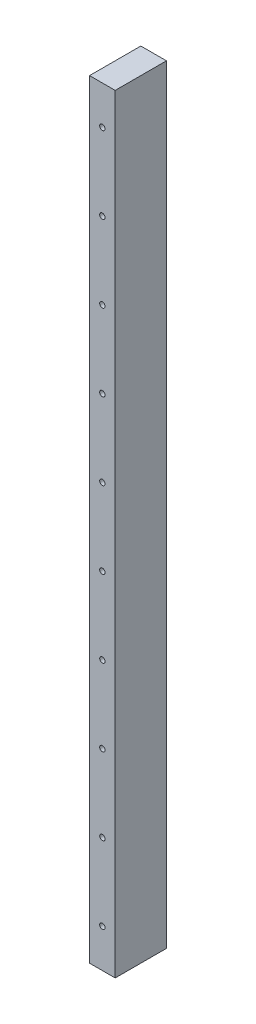
ISO-10303-21;
HEADER;
FILE_DESCRIPTION(('STEP AP214'),'2;1');
FILE_NAME('part.step','',(''),(''),'','','');
FILE_SCHEMA(('AUTOMOTIVE_DESIGN { 1 0 10303 214 1 1 1 1 }'));
ENDSEC;
DATA;
#1=APPLICATION_CONTEXT('core data for automotive mechanical design processes');
#2=APPLICATION_PROTOCOL_DEFINITION('international standard','automotive_design',2000,#1);
#3=PRODUCT_CONTEXT('',#1,'mechanical');
#4=PRODUCT('Part','Part','',(#3));
#5=PRODUCT_RELATED_PRODUCT_CATEGORY('part','',(#4));
#6=PRODUCT_DEFINITION_FORMATION('','',#4);
#7=PRODUCT_DEFINITION_CONTEXT('part definition',#1,'design');
#8=PRODUCT_DEFINITION('design','',#6,#7);
#9=PRODUCT_DEFINITION_SHAPE('','',#8);
#10=(LENGTH_UNIT() NAMED_UNIT(*) SI_UNIT(.MILLI.,.METRE.));
#11=(NAMED_UNIT(*) PLANE_ANGLE_UNIT() SI_UNIT($,.RADIAN.));
#12=(NAMED_UNIT(*) SI_UNIT($,.STERADIAN.) SOLID_ANGLE_UNIT());
#13=UNCERTAINTY_MEASURE_WITH_UNIT(LENGTH_MEASURE(1.E-05),#10,'distance_accuracy_value','');
#14=(GEOMETRIC_REPRESENTATION_CONTEXT(3) GLOBAL_UNCERTAINTY_ASSIGNED_CONTEXT((#13)) GLOBAL_UNIT_ASSIGNED_CONTEXT((#10,
#11,#12)) REPRESENTATION_CONTEXT('',''));
#15=CARTESIAN_POINT('',(0.,0.,0.));
#16=DIRECTION('',(0.,0.,1.));
#17=DIRECTION('',(1.,0.,0.));
#18=AXIS2_PLACEMENT_3D('',#15,#16,#17);
#19=CARTESIAN_POINT('',(-250.,1220.,-135.));
#20=DIRECTION('',(0.,-1.,0.));
#21=DIRECTION('',(0.,0.,-1.));
#22=AXIS2_PLACEMENT_3D('',#19,#20,#21);
#23=PLANE('',#22);
#24=DIRECTION('',(0.,0.,-1.));
#25=VECTOR('',#24,1.);
#26=CARTESIAN_POINT('',(-230.,1220.,-135.));
#27=LINE('',#26,#25);
#28=CARTESIAN_POINT('',(-230.,1220.,-135.));
#29=VERTEX_POINT('',#28);
#30=CARTESIAN_POINT('',(-230.,1220.,-175.));
#31=VERTEX_POINT('',#30);
#32=EDGE_CURVE('E249',#29,#31,#27,.T.);
#33=ORIENTED_EDGE('',*,*,#32,.F.);
#34=DIRECTION('',(1.,0.,0.));
#35=VECTOR('',#34,1.);
#36=CARTESIAN_POINT('',(-250.,1220.,-135.));
#37=LINE('',#36,#35);
#38=CARTESIAN_POINT('',(-250.,1220.,-135.));
#39=VERTEX_POINT('',#38);
#40=EDGE_CURVE('E11',#39,#29,#37,.T.);
#41=ORIENTED_EDGE('',*,*,#40,.F.);
#42=DIRECTION('',(0.,0.,-1.));
#43=VECTOR('',#42,1.);
#44=CARTESIAN_POINT('',(-250.,1220.,-135.));
#45=LINE('',#44,#43);
#46=CARTESIAN_POINT('',(-250.,1220.,-175.));
#47=VERTEX_POINT('',#46);
#48=EDGE_CURVE('E250',#39,#47,#45,.T.);
#49=ORIENTED_EDGE('',*,*,#48,.T.);
#50=DIRECTION('',(1.,0.,0.));
#51=VECTOR('',#50,1.);
#52=CARTESIAN_POINT('',(-250.,1220.,-175.));
#53=LINE('',#52,#51);
#54=EDGE_CURVE('E42',#47,#31,#53,.T.);
#55=ORIENTED_EDGE('',*,*,#54,.T.);
#56=EDGE_LOOP('',(#33,#41,#49,#55));
#57=FACE_BOUND('',#56,.T.);
#58=ADVANCED_FACE('F39',(#57),#23,.T.);
#59=CARTESIAN_POINT('',(-250.,1820.,-135.));
#60=DIRECTION('',(0.,0.,1.));
#61=DIRECTION('',(1.,0.,0.));
#62=AXIS2_PLACEMENT_3D('',#59,#60,#61);
#63=PLANE('',#62);
#64=CARTESIAN_POINT('',(-240.,1610.,-135.));
#65=DIRECTION('',(0.,0.,1.));
#66=DIRECTION('',(1.,0.,0.));
#67=AXIS2_PLACEMENT_3D('',#64,#65,#66);
#68=CIRCLE('',#67,2.09999999999999);
#69=CARTESIAN_POINT('',(-237.9,1610.,-135.));
#70=VERTEX_POINT('',#69);
#71=EDGE_CURVE('E140',#70,#70,#68,.T.);
#72=ORIENTED_EDGE('',*,*,#71,.F.);
#73=EDGE_LOOP('',(#72));
#74=FACE_BOUND('',#73,.T.);
#75=CARTESIAN_POINT('',(-240.,1250.,-135.));
#76=DIRECTION('',(0.,0.,1.));
#77=DIRECTION('',(1.,0.,0.));
#78=AXIS2_PLACEMENT_3D('',#75,#76,#77);
#79=CIRCLE('',#78,2.09999999999999);
#80=CARTESIAN_POINT('',(-237.9,1250.,-135.));
#81=VERTEX_POINT('',#80);
#82=EDGE_CURVE('E139',#81,#81,#79,.T.);
#83=ORIENTED_EDGE('',*,*,#82,.F.);
#84=EDGE_LOOP('',(#83));
#85=FACE_BOUND('',#84,.T.);
#86=CARTESIAN_POINT('',(-240.,1310.,-135.));
#87=DIRECTION('',(0.,0.,1.));
#88=DIRECTION('',(1.,0.,0.));
#89=AXIS2_PLACEMENT_3D('',#86,#87,#88);
#90=CIRCLE('',#89,2.09999999999999);
#91=CARTESIAN_POINT('',(-237.9,1310.,-135.));
#92=VERTEX_POINT('',#91);
#93=EDGE_CURVE('E153',#92,#92,#90,.T.);
#94=ORIENTED_EDGE('',*,*,#93,.F.);
#95=EDGE_LOOP('',(#94));
#96=FACE_BOUND('',#95,.T.);
#97=CARTESIAN_POINT('',(-240.,1370.,-135.));
#98=DIRECTION('',(0.,0.,1.));
#99=DIRECTION('',(1.,0.,0.));
#100=AXIS2_PLACEMENT_3D('',#97,#98,#99);
#101=CIRCLE('',#100,2.09999999999999);
#102=CARTESIAN_POINT('',(-237.9,1370.,-135.));
#103=VERTEX_POINT('',#102);
#104=EDGE_CURVE('E161',#103,#103,#101,.T.);
#105=ORIENTED_EDGE('',*,*,#104,.F.);
#106=EDGE_LOOP('',(#105));
#107=FACE_BOUND('',#106,.T.);
#108=CARTESIAN_POINT('',(-240.,1430.,-135.));
#109=DIRECTION('',(0.,0.,1.));
#110=DIRECTION('',(1.,0.,0.));
#111=AXIS2_PLACEMENT_3D('',#108,#109,#110);
#112=CIRCLE('',#111,2.09999999999999);
#113=CARTESIAN_POINT('',(-237.9,1430.,-135.));
#114=VERTEX_POINT('',#113);
#115=EDGE_CURVE('E169',#114,#114,#112,.T.);
#116=ORIENTED_EDGE('',*,*,#115,.F.);
#117=EDGE_LOOP('',(#116));
#118=FACE_BOUND('',#117,.T.);
#119=CARTESIAN_POINT('',(-240.,1490.,-135.));
#120=DIRECTION('',(0.,0.,1.));
#121=DIRECTION('',(1.,0.,0.));
#122=AXIS2_PLACEMENT_3D('',#119,#120,#121);
#123=CIRCLE('',#122,2.09999999999999);
#124=CARTESIAN_POINT('',(-237.9,1490.,-135.));
#125=VERTEX_POINT('',#124);
#126=EDGE_CURVE('E177',#125,#125,#123,.T.);
#127=ORIENTED_EDGE('',*,*,#126,.F.);
#128=EDGE_LOOP('',(#127));
#129=FACE_BOUND('',#128,.T.);
#130=CARTESIAN_POINT('',(-240.,1550.,-135.));
#131=DIRECTION('',(0.,0.,1.));
#132=DIRECTION('',(1.,0.,0.));
#133=AXIS2_PLACEMENT_3D('',#130,#131,#132);
#134=CIRCLE('',#133,2.09999999999999);
#135=CARTESIAN_POINT('',(-237.9,1550.,-135.));
#136=VERTEX_POINT('',#135);
#137=EDGE_CURVE('E185',#136,#136,#134,.T.);
#138=ORIENTED_EDGE('',*,*,#137,.F.);
#139=EDGE_LOOP('',(#138));
#140=FACE_BOUND('',#139,.T.);
#141=CARTESIAN_POINT('',(-240.,1670.,-135.));
#142=DIRECTION('',(0.,0.,1.));
#143=DIRECTION('',(1.,0.,0.));
#144=AXIS2_PLACEMENT_3D('',#141,#142,#143);
#145=CIRCLE('',#144,2.09999999999999);
#146=CARTESIAN_POINT('',(-237.9,1670.,-135.));
#147=VERTEX_POINT('',#146);
#148=EDGE_CURVE('E193',#147,#147,#145,.T.);
#149=ORIENTED_EDGE('',*,*,#148,.F.);
#150=EDGE_LOOP('',(#149));
#151=FACE_BOUND('',#150,.T.);
#152=CARTESIAN_POINT('',(-240.,1730.,-135.));
#153=DIRECTION('',(0.,0.,1.));
#154=DIRECTION('',(1.,0.,0.));
#155=AXIS2_PLACEMENT_3D('',#152,#153,#154);
#156=CIRCLE('',#155,2.09999999999999);
#157=CARTESIAN_POINT('',(-237.9,1730.,-135.));
#158=VERTEX_POINT('',#157);
#159=EDGE_CURVE('E201',#158,#158,#156,.T.);
#160=ORIENTED_EDGE('',*,*,#159,.F.);
#161=EDGE_LOOP('',(#160));
#162=FACE_BOUND('',#161,.T.);
#163=CARTESIAN_POINT('',(-240.,1790.,-135.));
#164=DIRECTION('',(0.,0.,1.));
#165=DIRECTION('',(1.,0.,0.));
#166=AXIS2_PLACEMENT_3D('',#163,#164,#165);
#167=CIRCLE('',#166,2.09999999999999);
#168=CARTESIAN_POINT('',(-237.9,1790.,-135.));
#169=VERTEX_POINT('',#168);
#170=EDGE_CURVE('E209',#169,#169,#167,.T.);
#171=ORIENTED_EDGE('',*,*,#170,.F.);
#172=EDGE_LOOP('',(#171));
#173=FACE_BOUND('',#172,.T.);
#174=DIRECTION('',(0.,-1.,0.));
#175=VECTOR('',#174,1.);
#176=CARTESIAN_POINT('',(-230.,1820.,-135.));
#177=LINE('',#176,#175);
#178=CARTESIAN_POINT('',(-230.,1820.,-135.));
#179=VERTEX_POINT('',#178);
#180=EDGE_CURVE('E254',#179,#29,#177,.T.);
#181=ORIENTED_EDGE('',*,*,#180,.F.);
#182=DIRECTION('',(1.,0.,0.));
#183=VECTOR('',#182,1.);
#184=CARTESIAN_POINT('',(-250.,1820.,-135.));
#185=LINE('',#184,#183);
#186=CARTESIAN_POINT('',(-250.,1820.,-135.));
#187=VERTEX_POINT('',#186);
#188=EDGE_CURVE('E49',#187,#179,#185,.T.);
#189=ORIENTED_EDGE('',*,*,#188,.F.);
#190=DIRECTION('',(0.,-1.,0.));
#191=VECTOR('',#190,1.);
#192=CARTESIAN_POINT('',(-250.,1820.,-135.));
#193=LINE('',#192,#191);
#194=EDGE_CURVE('E260',#187,#39,#193,.T.);
#195=ORIENTED_EDGE('',*,*,#194,.T.);
#196=ORIENTED_EDGE('',*,*,#40,.T.);
#197=EDGE_LOOP('',(#181,#189,#195,#196));
#198=FACE_BOUND('',#197,.T.);
#199=ADVANCED_FACE('F283',(#74,#85,#96,#107,#118,#129,#140,#151,#162,#173,#198),#63,.T.);
#200=CARTESIAN_POINT('',(-250.,1820.,-175.));
#201=DIRECTION('',(0.,1.,0.));
#202=DIRECTION('',(0.,0.,1.));
#203=AXIS2_PLACEMENT_3D('',#200,#201,#202);
#204=PLANE('',#203);
#205=DIRECTION('',(0.,0.,1.));
#206=VECTOR('',#205,1.);
#207=CARTESIAN_POINT('',(-230.,1820.,-175.));
#208=LINE('',#207,#206);
#209=CARTESIAN_POINT('',(-230.,1820.,-175.));
#210=VERTEX_POINT('',#209);
#211=EDGE_CURVE('E270',#210,#179,#208,.T.);
#212=ORIENTED_EDGE('',*,*,#211,.F.);
#213=DIRECTION('',(1.,0.,0.));
#214=VECTOR('',#213,1.);
#215=CARTESIAN_POINT('',(-250.,1820.,-175.));
#216=LINE('',#215,#214);
#217=CARTESIAN_POINT('',(-250.,1820.,-175.));
#218=VERTEX_POINT('',#217);
#219=EDGE_CURVE('E277',#218,#210,#216,.T.);
#220=ORIENTED_EDGE('',*,*,#219,.F.);
#221=DIRECTION('',(0.,0.,1.));
#222=VECTOR('',#221,1.);
#223=CARTESIAN_POINT('',(-250.,1820.,-175.));
#224=LINE('',#223,#222);
#225=EDGE_CURVE('E257',#218,#187,#224,.T.);
#226=ORIENTED_EDGE('',*,*,#225,.T.);
#227=ORIENTED_EDGE('',*,*,#188,.T.);
#228=EDGE_LOOP('',(#212,#220,#226,#227));
#229=FACE_BOUND('',#228,.T.);
#230=ADVANCED_FACE('F286',(#229),#204,.T.);
#231=CARTESIAN_POINT('',(-250.,1220.,-175.));
#232=DIRECTION('',(0.,0.,-1.));
#233=DIRECTION('',(-1.,0.,0.));
#234=AXIS2_PLACEMENT_3D('',#231,#232,#233);
#235=PLANE('',#234);
#236=CARTESIAN_POINT('',(-240.,1250.,-175.));
#237=DIRECTION('',(0.,0.,-1.));
#238=DIRECTION('',(-1.,0.,0.));
#239=AXIS2_PLACEMENT_3D('',#236,#237,#238);
#240=CIRCLE('',#239,4.5);
#241=CARTESIAN_POINT('',(-244.5,1250.,-175.));
#242=VERTEX_POINT('',#241);
#243=EDGE_CURVE('E217',#242,#242,#240,.T.);
#244=ORIENTED_EDGE('',*,*,#243,.F.);
#245=EDGE_LOOP('',(#244));
#246=FACE_BOUND('',#245,.T.);
#247=CARTESIAN_POINT('',(-240.,1430.,-175.));
#248=DIRECTION('',(0.,0.,-1.));
#249=DIRECTION('',(-1.,0.,0.));
#250=AXIS2_PLACEMENT_3D('',#247,#248,#249);
#251=CIRCLE('',#250,4.5);
#252=CARTESIAN_POINT('',(-244.5,1430.,-175.));
#253=VERTEX_POINT('',#252);
#254=EDGE_CURVE('E225',#253,#253,#251,.T.);
#255=ORIENTED_EDGE('',*,*,#254,.F.);
#256=EDGE_LOOP('',(#255));
#257=FACE_BOUND('',#256,.T.);
#258=CARTESIAN_POINT('',(-240.,1610.,-175.));
#259=DIRECTION('',(0.,0.,-1.));
#260=DIRECTION('',(-1.,0.,0.));
#261=AXIS2_PLACEMENT_3D('',#258,#259,#260);
#262=CIRCLE('',#261,4.5);
#263=CARTESIAN_POINT('',(-244.5,1610.,-175.));
#264=VERTEX_POINT('',#263);
#265=EDGE_CURVE('E233',#264,#264,#262,.T.);
#266=ORIENTED_EDGE('',*,*,#265,.F.);
#267=EDGE_LOOP('',(#266));
#268=FACE_BOUND('',#267,.T.);
#269=CARTESIAN_POINT('',(-240.,1790.,-175.));
#270=DIRECTION('',(0.,0.,-1.));
#271=DIRECTION('',(-1.,0.,0.));
#272=AXIS2_PLACEMENT_3D('',#269,#270,#271);
#273=CIRCLE('',#272,4.5);
#274=CARTESIAN_POINT('',(-244.5,1790.,-175.));
#275=VERTEX_POINT('',#274);
#276=EDGE_CURVE('E241',#275,#275,#273,.T.);
#277=ORIENTED_EDGE('',*,*,#276,.F.);
#278=EDGE_LOOP('',(#277));
#279=FACE_BOUND('',#278,.T.);
#280=DIRECTION('',(0.,1.,0.));
#281=VECTOR('',#280,1.);
#282=CARTESIAN_POINT('',(-230.,1220.,-175.));
#283=LINE('',#282,#281);
#284=EDGE_CURVE('E266',#31,#210,#283,.T.);
#285=ORIENTED_EDGE('',*,*,#284,.F.);
#286=ORIENTED_EDGE('',*,*,#54,.F.);
#287=DIRECTION('',(0.,1.,0.));
#288=VECTOR('',#287,1.);
#289=CARTESIAN_POINT('',(-250.,1220.,-175.));
#290=LINE('',#289,#288);
#291=EDGE_CURVE('E253',#47,#218,#290,.T.);
#292=ORIENTED_EDGE('',*,*,#291,.T.);
#293=ORIENTED_EDGE('',*,*,#219,.T.);
#294=EDGE_LOOP('',(#285,#286,#292,#293));
#295=FACE_BOUND('',#294,.T.);
#296=ADVANCED_FACE('F280',(#246,#257,#268,#279,#295),#235,.T.);
#297=CARTESIAN_POINT('',(-250.,0.,0.));
#298=DIRECTION('',(1.,0.,0.));
#299=DIRECTION('',(0.,0.,-1.));
#300=AXIS2_PLACEMENT_3D('',#297,#298,#299);
#301=PLANE('',#300);
#302=ORIENTED_EDGE('',*,*,#48,.F.);
#303=ORIENTED_EDGE('',*,*,#194,.F.);
#304=ORIENTED_EDGE('',*,*,#225,.F.);
#305=ORIENTED_EDGE('',*,*,#291,.F.);
#306=EDGE_LOOP('',(#302,#303,#304,#305));
#307=FACE_BOUND('',#306,.T.);
#308=ADVANCED_FACE('F288',(#307),#301,.F.);
#309=CARTESIAN_POINT('',(-230.,0.,0.));
#310=DIRECTION('',(1.,0.,0.));
#311=DIRECTION('',(0.,0.,-1.));
#312=AXIS2_PLACEMENT_3D('',#309,#310,#311);
#313=PLANE('',#312);
#314=ORIENTED_EDGE('',*,*,#32,.T.);
#315=ORIENTED_EDGE('',*,*,#284,.T.);
#316=ORIENTED_EDGE('',*,*,#211,.T.);
#317=ORIENTED_EDGE('',*,*,#180,.T.);
#318=EDGE_LOOP('',(#314,#315,#316,#317));
#319=FACE_BOUND('',#318,.T.);
#320=ADVANCED_FACE('F282',(#319),#313,.T.);
#321=CARTESIAN_POINT('',(-240.,1790.,-160.));
#322=DIRECTION('',(0.,0.,-1.));
#323=DIRECTION('',(-1.,0.,0.));
#324=AXIS2_PLACEMENT_3D('',#321,#322,#323);
#325=CONICAL_SURFACE('',#324,4.5,1.02974425867665);
#326=CARTESIAN_POINT('',(-240.,1790.,-157.296127214376));
#327=VERTEX_POINT('',#326);
#328=VERTEX_LOOP('',#327);
#329=FACE_BOUND('',#328,.T.);
#330=CARTESIAN_POINT('',(-240.,1790.,-160.));
#331=DIRECTION('',(0.,0.,-1.));
#332=DIRECTION('',(-1.,0.,0.));
#333=AXIS2_PLACEMENT_3D('',#330,#331,#332);
#334=CIRCLE('',#333,4.5);
#335=CARTESIAN_POINT('',(-244.5,1790.,-160.));
#336=VERTEX_POINT('',#335);
#337=EDGE_CURVE('E245',#336,#336,#334,.T.);
#338=ORIENTED_EDGE('',*,*,#337,.T.);
#339=EDGE_LOOP('',(#338));
#340=FACE_BOUND('',#339,.T.);
#341=ADVANCED_FACE('F295',(#329,#340),#325,.F.);
#342=CARTESIAN_POINT('',(-240.,1790.,-175.));
#343=DIRECTION('',(0.,0.,-1.));
#344=DIRECTION('',(-1.,0.,0.));
#345=AXIS2_PLACEMENT_3D('',#342,#343,#344);
#346=CYLINDRICAL_SURFACE('',#345,4.5);
#347=ORIENTED_EDGE('',*,*,#337,.F.);
#348=EDGE_LOOP('',(#347));
#349=FACE_BOUND('',#348,.T.);
#350=ORIENTED_EDGE('',*,*,#276,.T.);
#351=EDGE_LOOP('',(#350));
#352=FACE_BOUND('',#351,.T.);
#353=ADVANCED_FACE('F370',(#349,#352),#346,.F.);
#354=CARTESIAN_POINT('',(-240.,1610.,-160.));
#355=DIRECTION('',(0.,0.,-1.));
#356=DIRECTION('',(-1.,0.,0.));
#357=AXIS2_PLACEMENT_3D('',#354,#355,#356);
#358=CONICAL_SURFACE('',#357,4.5,1.02974425867665);
#359=CARTESIAN_POINT('',(-240.,1610.,-157.296127214376));
#360=VERTEX_POINT('',#359);
#361=VERTEX_LOOP('',#360);
#362=FACE_BOUND('',#361,.T.);
#363=CARTESIAN_POINT('',(-240.,1610.,-160.));
#364=DIRECTION('',(0.,0.,-1.));
#365=DIRECTION('',(-1.,0.,0.));
#366=AXIS2_PLACEMENT_3D('',#363,#364,#365);
#367=CIRCLE('',#366,4.5);
#368=CARTESIAN_POINT('',(-244.5,1610.,-160.));
#369=VERTEX_POINT('',#368);
#370=EDGE_CURVE('E237',#369,#369,#367,.T.);
#371=ORIENTED_EDGE('',*,*,#370,.T.);
#372=EDGE_LOOP('',(#371));
#373=FACE_BOUND('',#372,.T.);
#374=ADVANCED_FACE('F366',(#362,#373),#358,.F.);
#375=CARTESIAN_POINT('',(-240.,1610.,-175.));
#376=DIRECTION('',(0.,0.,-1.));
#377=DIRECTION('',(-1.,0.,0.));
#378=AXIS2_PLACEMENT_3D('',#375,#376,#377);
#379=CYLINDRICAL_SURFACE('',#378,4.5);
#380=ORIENTED_EDGE('',*,*,#370,.F.);
#381=EDGE_LOOP('',(#380));
#382=FACE_BOUND('',#381,.T.);
#383=ORIENTED_EDGE('',*,*,#265,.T.);
#384=EDGE_LOOP('',(#383));
#385=FACE_BOUND('',#384,.T.);
#386=ADVANCED_FACE('F362',(#382,#385),#379,.F.);
#387=CARTESIAN_POINT('',(-240.,1430.,-160.));
#388=DIRECTION('',(0.,0.,-1.));
#389=DIRECTION('',(-1.,0.,0.));
#390=AXIS2_PLACEMENT_3D('',#387,#388,#389);
#391=CONICAL_SURFACE('',#390,4.5,1.02974425867665);
#392=CARTESIAN_POINT('',(-240.,1430.,-157.296127214376));
#393=VERTEX_POINT('',#392);
#394=VERTEX_LOOP('',#393);
#395=FACE_BOUND('',#394,.T.);
#396=CARTESIAN_POINT('',(-240.,1430.,-160.));
#397=DIRECTION('',(0.,0.,-1.));
#398=DIRECTION('',(-1.,0.,0.));
#399=AXIS2_PLACEMENT_3D('',#396,#397,#398);
#400=CIRCLE('',#399,4.5);
#401=CARTESIAN_POINT('',(-244.5,1430.,-160.));
#402=VERTEX_POINT('',#401);
#403=EDGE_CURVE('E229',#402,#402,#400,.T.);
#404=ORIENTED_EDGE('',*,*,#403,.T.);
#405=EDGE_LOOP('',(#404));
#406=FACE_BOUND('',#405,.T.);
#407=ADVANCED_FACE('F358',(#395,#406),#391,.F.);
#408=CARTESIAN_POINT('',(-240.,1430.,-175.));
#409=DIRECTION('',(0.,0.,-1.));
#410=DIRECTION('',(-1.,0.,0.));
#411=AXIS2_PLACEMENT_3D('',#408,#409,#410);
#412=CYLINDRICAL_SURFACE('',#411,4.5);
#413=ORIENTED_EDGE('',*,*,#403,.F.);
#414=EDGE_LOOP('',(#413));
#415=FACE_BOUND('',#414,.T.);
#416=ORIENTED_EDGE('',*,*,#254,.T.);
#417=EDGE_LOOP('',(#416));
#418=FACE_BOUND('',#417,.T.);
#419=ADVANCED_FACE('F354',(#415,#418),#412,.F.);
#420=CARTESIAN_POINT('',(-240.,1250.,-160.));
#421=DIRECTION('',(0.,0.,-1.));
#422=DIRECTION('',(-1.,0.,0.));
#423=AXIS2_PLACEMENT_3D('',#420,#421,#422);
#424=CONICAL_SURFACE('',#423,4.5,1.02974425867665);
#425=CARTESIAN_POINT('',(-240.,1250.,-157.296127214376));
#426=VERTEX_POINT('',#425);
#427=VERTEX_LOOP('',#426);
#428=FACE_BOUND('',#427,.T.);
#429=CARTESIAN_POINT('',(-240.,1250.,-160.));
#430=DIRECTION('',(0.,0.,-1.));
#431=DIRECTION('',(-1.,0.,0.));
#432=AXIS2_PLACEMENT_3D('',#429,#430,#431);
#433=CIRCLE('',#432,4.5);
#434=CARTESIAN_POINT('',(-244.5,1250.,-160.));
#435=VERTEX_POINT('',#434);
#436=EDGE_CURVE('E221',#435,#435,#433,.T.);
#437=ORIENTED_EDGE('',*,*,#436,.T.);
#438=EDGE_LOOP('',(#437));
#439=FACE_BOUND('',#438,.T.);
#440=ADVANCED_FACE('F350',(#428,#439),#424,.F.);
#441=CARTESIAN_POINT('',(-240.,1250.,-175.));
#442=DIRECTION('',(0.,0.,-1.));
#443=DIRECTION('',(-1.,0.,0.));
#444=AXIS2_PLACEMENT_3D('',#441,#442,#443);
#445=CYLINDRICAL_SURFACE('',#444,4.5);
#446=ORIENTED_EDGE('',*,*,#436,.F.);
#447=EDGE_LOOP('',(#446));
#448=FACE_BOUND('',#447,.T.);
#449=ORIENTED_EDGE('',*,*,#243,.T.);
#450=EDGE_LOOP('',(#449));
#451=FACE_BOUND('',#450,.T.);
#452=ADVANCED_FACE('F342',(#448,#451),#445,.F.);
#453=CARTESIAN_POINT('',(-240.,1790.,-147.4));
#454=DIRECTION('',(0.,0.,1.));
#455=DIRECTION('',(1.,0.,0.));
#456=AXIS2_PLACEMENT_3D('',#453,#454,#455);
#457=CONICAL_SURFACE('',#456,2.09999999999999,1.02974425867665);
#458=CARTESIAN_POINT('',(-240.,1790.,-148.661807299958));
#459=VERTEX_POINT('',#458);
#460=VERTEX_LOOP('',#459);
#461=FACE_BOUND('',#460,.T.);
#462=CARTESIAN_POINT('',(-240.,1790.,-147.4));
#463=DIRECTION('',(0.,0.,1.));
#464=DIRECTION('',(1.,0.,0.));
#465=AXIS2_PLACEMENT_3D('',#462,#463,#464);
#466=CIRCLE('',#465,2.09999999999999);
#467=CARTESIAN_POINT('',(-237.9,1790.,-147.4));
#468=VERTEX_POINT('',#467);
#469=EDGE_CURVE('E213',#468,#468,#466,.T.);
#470=ORIENTED_EDGE('',*,*,#469,.T.);
#471=EDGE_LOOP('',(#470));
#472=FACE_BOUND('',#471,.T.);
#473=ADVANCED_FACE('F332',(#461,#472),#457,.F.);
#474=CARTESIAN_POINT('',(-240.,1790.,-135.));
#475=DIRECTION('',(0.,0.,1.));
#476=DIRECTION('',(1.,0.,0.));
#477=AXIS2_PLACEMENT_3D('',#474,#475,#476);
#478=CYLINDRICAL_SURFACE('',#477,2.09999999999999);
#479=ORIENTED_EDGE('',*,*,#469,.F.);
#480=EDGE_LOOP('',(#479));
#481=FACE_BOUND('',#480,.T.);
#482=ORIENTED_EDGE('',*,*,#170,.T.);
#483=EDGE_LOOP('',(#482));
#484=FACE_BOUND('',#483,.T.);
#485=ADVANCED_FACE('F329',(#481,#484),#478,.F.);
#486=CARTESIAN_POINT('',(-240.,1730.,-147.4));
#487=DIRECTION('',(0.,0.,1.));
#488=DIRECTION('',(1.,0.,0.));
#489=AXIS2_PLACEMENT_3D('',#486,#487,#488);
#490=CONICAL_SURFACE('',#489,2.09999999999999,1.02974425867665);
#491=CARTESIAN_POINT('',(-240.,1730.,-148.661807299958));
#492=VERTEX_POINT('',#491);
#493=VERTEX_LOOP('',#492);
#494=FACE_BOUND('',#493,.T.);
#495=CARTESIAN_POINT('',(-240.,1730.,-147.4));
#496=DIRECTION('',(0.,0.,1.));
#497=DIRECTION('',(1.,0.,0.));
#498=AXIS2_PLACEMENT_3D('',#495,#496,#497);
#499=CIRCLE('',#498,2.09999999999999);
#500=CARTESIAN_POINT('',(-237.9,1730.,-147.4));
#501=VERTEX_POINT('',#500);
#502=EDGE_CURVE('E205',#501,#501,#499,.T.);
#503=ORIENTED_EDGE('',*,*,#502,.T.);
#504=EDGE_LOOP('',(#503));
#505=FACE_BOUND('',#504,.T.);
#506=ADVANCED_FACE('F331',(#494,#505),#490,.F.);
#507=CARTESIAN_POINT('',(-240.,1730.,-135.));
#508=DIRECTION('',(0.,0.,1.));
#509=DIRECTION('',(1.,0.,0.));
#510=AXIS2_PLACEMENT_3D('',#507,#508,#509);
#511=CYLINDRICAL_SURFACE('',#510,2.09999999999999);
#512=ORIENTED_EDGE('',*,*,#502,.F.);
#513=EDGE_LOOP('',(#512));
#514=FACE_BOUND('',#513,.T.);
#515=ORIENTED_EDGE('',*,*,#159,.T.);
#516=EDGE_LOOP('',(#515));
#517=FACE_BOUND('',#516,.T.);
#518=ADVANCED_FACE('F339',(#514,#517),#511,.F.);
#519=CARTESIAN_POINT('',(-240.,1670.,-147.4));
#520=DIRECTION('',(0.,0.,1.));
#521=DIRECTION('',(1.,0.,0.));
#522=AXIS2_PLACEMENT_3D('',#519,#520,#521);
#523=CONICAL_SURFACE('',#522,2.09999999999999,1.02974425867665);
#524=CARTESIAN_POINT('',(-240.,1670.,-148.661807299958));
#525=VERTEX_POINT('',#524);
#526=VERTEX_LOOP('',#525);
#527=FACE_BOUND('',#526,.T.);
#528=CARTESIAN_POINT('',(-240.,1670.,-147.4));
#529=DIRECTION('',(0.,0.,1.));
#530=DIRECTION('',(1.,0.,0.));
#531=AXIS2_PLACEMENT_3D('',#528,#529,#530);
#532=CIRCLE('',#531,2.09999999999999);
#533=CARTESIAN_POINT('',(-237.9,1670.,-147.4));
#534=VERTEX_POINT('',#533);
#535=EDGE_CURVE('E197',#534,#534,#532,.T.);
#536=ORIENTED_EDGE('',*,*,#535,.T.);
#537=EDGE_LOOP('',(#536));
#538=FACE_BOUND('',#537,.T.);
#539=ADVANCED_FACE('F439',(#527,#538),#523,.F.);
#540=CARTESIAN_POINT('',(-240.,1670.,-135.));
#541=DIRECTION('',(0.,0.,1.));
#542=DIRECTION('',(1.,0.,0.));
#543=AXIS2_PLACEMENT_3D('',#540,#541,#542);
#544=CYLINDRICAL_SURFACE('',#543,2.09999999999999);
#545=ORIENTED_EDGE('',*,*,#535,.F.);
#546=EDGE_LOOP('',(#545));
#547=FACE_BOUND('',#546,.T.);
#548=ORIENTED_EDGE('',*,*,#148,.T.);
#549=EDGE_LOOP('',(#548));
#550=FACE_BOUND('',#549,.T.);
#551=ADVANCED_FACE('F448',(#547,#550),#544,.F.);
#552=CARTESIAN_POINT('',(-240.,1550.,-147.4));
#553=DIRECTION('',(0.,0.,1.));
#554=DIRECTION('',(1.,0.,0.));
#555=AXIS2_PLACEMENT_3D('',#552,#553,#554);
#556=CONICAL_SURFACE('',#555,2.09999999999999,1.02974425867665);
#557=CARTESIAN_POINT('',(-240.,1550.,-148.661807299958));
#558=VERTEX_POINT('',#557);
#559=VERTEX_LOOP('',#558);
#560=FACE_BOUND('',#559,.T.);
#561=CARTESIAN_POINT('',(-240.,1550.,-147.4));
#562=DIRECTION('',(0.,0.,1.));
#563=DIRECTION('',(1.,0.,0.));
#564=AXIS2_PLACEMENT_3D('',#561,#562,#563);
#565=CIRCLE('',#564,2.09999999999999);
#566=CARTESIAN_POINT('',(-237.9,1550.,-147.4));
#567=VERTEX_POINT('',#566);
#568=EDGE_CURVE('E189',#567,#567,#565,.T.);
#569=ORIENTED_EDGE('',*,*,#568,.T.);
#570=EDGE_LOOP('',(#569));
#571=FACE_BOUND('',#570,.T.);
#572=ADVANCED_FACE('F458',(#560,#571),#556,.F.);
#573=CARTESIAN_POINT('',(-240.,1550.,-135.));
#574=DIRECTION('',(0.,0.,1.));
#575=DIRECTION('',(1.,0.,0.));
#576=AXIS2_PLACEMENT_3D('',#573,#574,#575);
#577=CYLINDRICAL_SURFACE('',#576,2.09999999999999);
#578=ORIENTED_EDGE('',*,*,#568,.F.);
#579=EDGE_LOOP('',(#578));
#580=FACE_BOUND('',#579,.T.);
#581=ORIENTED_EDGE('',*,*,#137,.T.);
#582=EDGE_LOOP('',(#581));
#583=FACE_BOUND('',#582,.T.);
#584=ADVANCED_FACE('F468',(#580,#583),#577,.F.);
#585=CARTESIAN_POINT('',(-240.,1490.,-147.4));
#586=DIRECTION('',(0.,0.,1.));
#587=DIRECTION('',(1.,0.,0.));
#588=AXIS2_PLACEMENT_3D('',#585,#586,#587);
#589=CONICAL_SURFACE('',#588,2.09999999999999,1.02974425867665);
#590=CARTESIAN_POINT('',(-240.,1490.,-148.661807299958));
#591=VERTEX_POINT('',#590);
#592=VERTEX_LOOP('',#591);
#593=FACE_BOUND('',#592,.T.);
#594=CARTESIAN_POINT('',(-240.,1490.,-147.4));
#595=DIRECTION('',(0.,0.,1.));
#596=DIRECTION('',(1.,0.,0.));
#597=AXIS2_PLACEMENT_3D('',#594,#595,#596);
#598=CIRCLE('',#597,2.09999999999999);
#599=CARTESIAN_POINT('',(-237.9,1490.,-147.4));
#600=VERTEX_POINT('',#599);
#601=EDGE_CURVE('E181',#600,#600,#598,.T.);
#602=ORIENTED_EDGE('',*,*,#601,.T.);
#603=EDGE_LOOP('',(#602));
#604=FACE_BOUND('',#603,.T.);
#605=ADVANCED_FACE('F478',(#593,#604),#589,.F.);
#606=CARTESIAN_POINT('',(-240.,1490.,-135.));
#607=DIRECTION('',(0.,0.,1.));
#608=DIRECTION('',(1.,0.,0.));
#609=AXIS2_PLACEMENT_3D('',#606,#607,#608);
#610=CYLINDRICAL_SURFACE('',#609,2.09999999999999);
#611=ORIENTED_EDGE('',*,*,#601,.F.);
#612=EDGE_LOOP('',(#611));
#613=FACE_BOUND('',#612,.T.);
#614=ORIENTED_EDGE('',*,*,#126,.T.);
#615=EDGE_LOOP('',(#614));
#616=FACE_BOUND('',#615,.T.);
#617=ADVANCED_FACE('F488',(#613,#616),#610,.F.);
#618=CARTESIAN_POINT('',(-240.,1430.,-147.4));
#619=DIRECTION('',(0.,0.,1.));
#620=DIRECTION('',(1.,0.,0.));
#621=AXIS2_PLACEMENT_3D('',#618,#619,#620);
#622=CONICAL_SURFACE('',#621,2.09999999999999,1.02974425867665);
#623=CARTESIAN_POINT('',(-240.,1430.,-148.661807299958));
#624=VERTEX_POINT('',#623);
#625=VERTEX_LOOP('',#624);
#626=FACE_BOUND('',#625,.T.);
#627=CARTESIAN_POINT('',(-240.,1430.,-147.4));
#628=DIRECTION('',(0.,0.,1.));
#629=DIRECTION('',(1.,0.,0.));
#630=AXIS2_PLACEMENT_3D('',#627,#628,#629);
#631=CIRCLE('',#630,2.09999999999999);
#632=CARTESIAN_POINT('',(-237.9,1430.,-147.4));
#633=VERTEX_POINT('',#632);
#634=EDGE_CURVE('E173',#633,#633,#631,.T.);
#635=ORIENTED_EDGE('',*,*,#634,.T.);
#636=EDGE_LOOP('',(#635));
#637=FACE_BOUND('',#636,.T.);
#638=ADVANCED_FACE('F498',(#626,#637),#622,.F.);
#639=CARTESIAN_POINT('',(-240.,1430.,-135.));
#640=DIRECTION('',(0.,0.,1.));
#641=DIRECTION('',(1.,0.,0.));
#642=AXIS2_PLACEMENT_3D('',#639,#640,#641);
#643=CYLINDRICAL_SURFACE('',#642,2.09999999999999);
#644=ORIENTED_EDGE('',*,*,#634,.F.);
#645=EDGE_LOOP('',(#644));
#646=FACE_BOUND('',#645,.T.);
#647=ORIENTED_EDGE('',*,*,#115,.T.);
#648=EDGE_LOOP('',(#647));
#649=FACE_BOUND('',#648,.T.);
#650=ADVANCED_FACE('F508',(#646,#649),#643,.F.);
#651=CARTESIAN_POINT('',(-240.,1370.,-147.4));
#652=DIRECTION('',(0.,0.,1.));
#653=DIRECTION('',(1.,0.,0.));
#654=AXIS2_PLACEMENT_3D('',#651,#652,#653);
#655=CONICAL_SURFACE('',#654,2.09999999999999,1.02974425867665);
#656=CARTESIAN_POINT('',(-240.,1370.,-148.661807299958));
#657=VERTEX_POINT('',#656);
#658=VERTEX_LOOP('',#657);
#659=FACE_BOUND('',#658,.T.);
#660=CARTESIAN_POINT('',(-240.,1370.,-147.4));
#661=DIRECTION('',(0.,0.,1.));
#662=DIRECTION('',(1.,0.,0.));
#663=AXIS2_PLACEMENT_3D('',#660,#661,#662);
#664=CIRCLE('',#663,2.09999999999999);
#665=CARTESIAN_POINT('',(-237.9,1370.,-147.4));
#666=VERTEX_POINT('',#665);
#667=EDGE_CURVE('E165',#666,#666,#664,.T.);
#668=ORIENTED_EDGE('',*,*,#667,.T.);
#669=EDGE_LOOP('',(#668));
#670=FACE_BOUND('',#669,.T.);
#671=ADVANCED_FACE('F518',(#659,#670),#655,.F.);
#672=CARTESIAN_POINT('',(-240.,1370.,-135.));
#673=DIRECTION('',(0.,0.,1.));
#674=DIRECTION('',(1.,0.,0.));
#675=AXIS2_PLACEMENT_3D('',#672,#673,#674);
#676=CYLINDRICAL_SURFACE('',#675,2.09999999999999);
#677=ORIENTED_EDGE('',*,*,#667,.F.);
#678=EDGE_LOOP('',(#677));
#679=FACE_BOUND('',#678,.T.);
#680=ORIENTED_EDGE('',*,*,#104,.T.);
#681=EDGE_LOOP('',(#680));
#682=FACE_BOUND('',#681,.T.);
#683=ADVANCED_FACE('F528',(#679,#682),#676,.F.);
#684=CARTESIAN_POINT('',(-240.,1310.,-147.4));
#685=DIRECTION('',(0.,0.,1.));
#686=DIRECTION('',(1.,0.,0.));
#687=AXIS2_PLACEMENT_3D('',#684,#685,#686);
#688=CONICAL_SURFACE('',#687,2.09999999999999,1.02974425867665);
#689=CARTESIAN_POINT('',(-240.,1310.,-148.661807299958));
#690=VERTEX_POINT('',#689);
#691=VERTEX_LOOP('',#690);
#692=FACE_BOUND('',#691,.T.);
#693=CARTESIAN_POINT('',(-240.,1310.,-147.4));
#694=DIRECTION('',(0.,0.,1.));
#695=DIRECTION('',(1.,0.,0.));
#696=AXIS2_PLACEMENT_3D('',#693,#694,#695);
#697=CIRCLE('',#696,2.09999999999999);
#698=CARTESIAN_POINT('',(-237.9,1310.,-147.4));
#699=VERTEX_POINT('',#698);
#700=EDGE_CURVE('E157',#699,#699,#697,.T.);
#701=ORIENTED_EDGE('',*,*,#700,.T.);
#702=EDGE_LOOP('',(#701));
#703=FACE_BOUND('',#702,.T.);
#704=ADVANCED_FACE('F538',(#692,#703),#688,.F.);
#705=CARTESIAN_POINT('',(-240.,1310.,-135.));
#706=DIRECTION('',(0.,0.,1.));
#707=DIRECTION('',(1.,0.,0.));
#708=AXIS2_PLACEMENT_3D('',#705,#706,#707);
#709=CYLINDRICAL_SURFACE('',#708,2.09999999999999);
#710=ORIENTED_EDGE('',*,*,#700,.F.);
#711=EDGE_LOOP('',(#710));
#712=FACE_BOUND('',#711,.T.);
#713=ORIENTED_EDGE('',*,*,#93,.T.);
#714=EDGE_LOOP('',(#713));
#715=FACE_BOUND('',#714,.T.);
#716=ADVANCED_FACE('F548',(#712,#715),#709,.F.);
#717=CARTESIAN_POINT('',(-240.,1250.,-147.4));
#718=DIRECTION('',(0.,0.,1.));
#719=DIRECTION('',(1.,0.,0.));
#720=AXIS2_PLACEMENT_3D('',#717,#718,#719);
#721=CONICAL_SURFACE('',#720,2.09999999999999,1.02974425867665);
#722=CARTESIAN_POINT('',(-240.,1250.,-148.661807299958));
#723=VERTEX_POINT('',#722);
#724=VERTEX_LOOP('',#723);
#725=FACE_BOUND('',#724,.T.);
#726=CARTESIAN_POINT('',(-240.,1250.,-147.4));
#727=DIRECTION('',(0.,0.,1.));
#728=DIRECTION('',(1.,0.,0.));
#729=AXIS2_PLACEMENT_3D('',#726,#727,#728);
#730=CIRCLE('',#729,2.09999999999999);
#731=CARTESIAN_POINT('',(-237.9,1250.,-147.4));
#732=VERTEX_POINT('',#731);
#733=EDGE_CURVE('E145',#732,#732,#730,.T.);
#734=ORIENTED_EDGE('',*,*,#733,.T.);
#735=EDGE_LOOP('',(#734));
#736=FACE_BOUND('',#735,.T.);
#737=ADVANCED_FACE('F558',(#725,#736),#721,.F.);
#738=CARTESIAN_POINT('',(-240.,1250.,-135.));
#739=DIRECTION('',(0.,0.,1.));
#740=DIRECTION('',(1.,0.,0.));
#741=AXIS2_PLACEMENT_3D('',#738,#739,#740);
#742=CYLINDRICAL_SURFACE('',#741,2.09999999999999);
#743=ORIENTED_EDGE('',*,*,#733,.F.);
#744=EDGE_LOOP('',(#743));
#745=FACE_BOUND('',#744,.T.);
#746=ORIENTED_EDGE('',*,*,#82,.T.);
#747=EDGE_LOOP('',(#746));
#748=FACE_BOUND('',#747,.T.);
#749=ADVANCED_FACE('F132',(#745,#748),#742,.F.);
#750=CARTESIAN_POINT('',(-240.,1610.,-147.4));
#751=DIRECTION('',(0.,0.,1.));
#752=DIRECTION('',(1.,0.,0.));
#753=AXIS2_PLACEMENT_3D('',#750,#751,#752);
#754=CONICAL_SURFACE('',#753,2.09999999999999,1.02974425867665);
#755=CARTESIAN_POINT('',(-240.,1610.,-148.661807299958));
#756=VERTEX_POINT('',#755);
#757=VERTEX_LOOP('',#756);
#758=FACE_BOUND('',#757,.T.);
#759=CARTESIAN_POINT('',(-240.,1610.,-147.4));
#760=DIRECTION('',(0.,0.,1.));
#761=DIRECTION('',(1.,0.,0.));
#762=AXIS2_PLACEMENT_3D('',#759,#760,#761);
#763=CIRCLE('',#762,2.09999999999999);
#764=CARTESIAN_POINT('',(-237.9,1610.,-147.4));
#765=VERTEX_POINT('',#764);
#766=EDGE_CURVE('E136',#765,#765,#763,.T.);
#767=ORIENTED_EDGE('',*,*,#766,.T.);
#768=EDGE_LOOP('',(#767));
#769=FACE_BOUND('',#768,.T.);
#770=ADVANCED_FACE('F128',(#758,#769),#754,.F.);
#771=CARTESIAN_POINT('',(-240.,1610.,-135.));
#772=DIRECTION('',(0.,0.,1.));
#773=DIRECTION('',(1.,0.,0.));
#774=AXIS2_PLACEMENT_3D('',#771,#772,#773);
#775=CYLINDRICAL_SURFACE('',#774,2.09999999999999);
#776=ORIENTED_EDGE('',*,*,#766,.F.);
#777=EDGE_LOOP('',(#776));
#778=FACE_BOUND('',#777,.T.);
#779=ORIENTED_EDGE('',*,*,#71,.T.);
#780=EDGE_LOOP('',(#779));
#781=FACE_BOUND('',#780,.T.);
#782=ADVANCED_FACE('F131',(#778,#781),#775,.F.);
#783=CLOSED_SHELL('',(#58,#199,#230,#296,#308,#320,#341,#353,#374,#386,#407,#419,#440,#452,#473,
#485,#506,#518,#539,#551,#572,#584,#605,#617,#638,#650,#671,#683,#704,#716,#737,#749,#770,#782));
#784=MANIFOLD_SOLID_BREP('B2',#783);
#785=ADVANCED_BREP_SHAPE_REPRESENTATION('',(#18,#784),#14);
#786=SHAPE_DEFINITION_REPRESENTATION(#9,#785);
ENDSEC;
END-ISO-10303-21;
